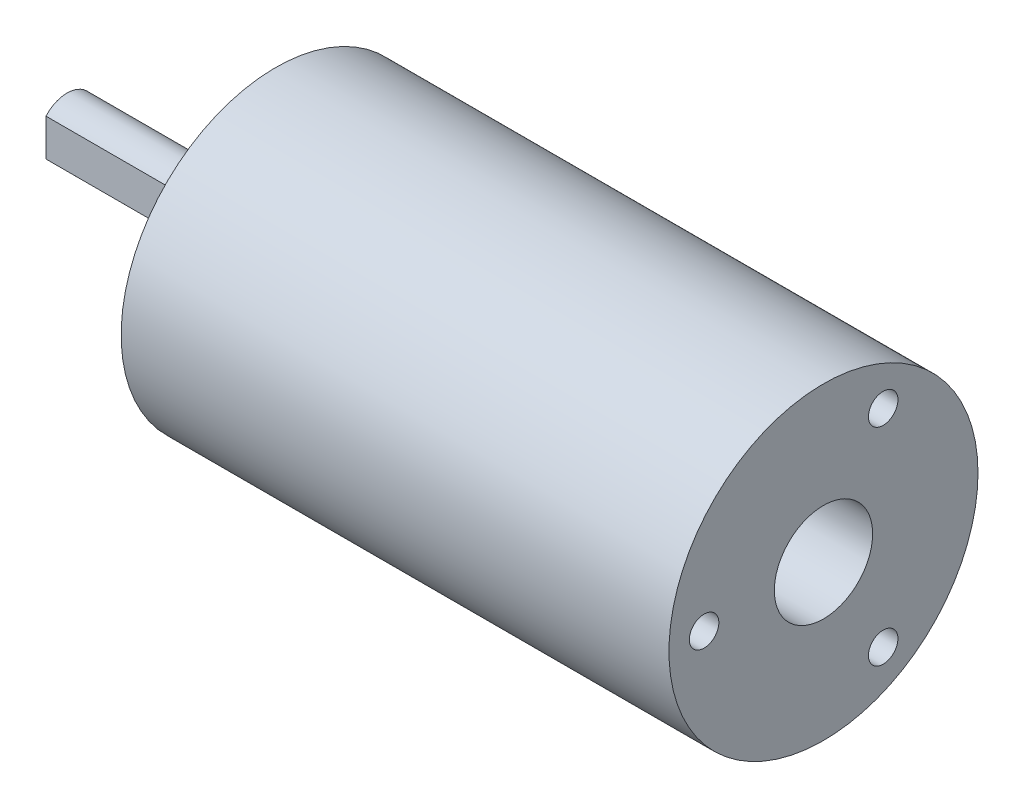
ISO-10303-21;
HEADER;
FILE_DESCRIPTION(('STEP AP214'),'2;1');
FILE_NAME('part.step','',(''),(''),'','','');
FILE_SCHEMA(('AUTOMOTIVE_DESIGN { 1 0 10303 214 1 1 1 1 }'));
ENDSEC;
DATA;
#1=APPLICATION_CONTEXT('core data for automotive mechanical design processes');
#2=APPLICATION_PROTOCOL_DEFINITION('international standard','automotive_design',2000,#1);
#3=PRODUCT_CONTEXT('',#1,'mechanical');
#4=PRODUCT('Part','Part','',(#3));
#5=PRODUCT_RELATED_PRODUCT_CATEGORY('part','',(#4));
#6=PRODUCT_DEFINITION_FORMATION('','',#4);
#7=PRODUCT_DEFINITION_CONTEXT('part definition',#1,'design');
#8=PRODUCT_DEFINITION('design','',#6,#7);
#9=PRODUCT_DEFINITION_SHAPE('','',#8);
#10=(LENGTH_UNIT() NAMED_UNIT(*) SI_UNIT(.MILLI.,.METRE.));
#11=(NAMED_UNIT(*) PLANE_ANGLE_UNIT() SI_UNIT($,.RADIAN.));
#12=(NAMED_UNIT(*) SI_UNIT($,.STERADIAN.) SOLID_ANGLE_UNIT());
#13=UNCERTAINTY_MEASURE_WITH_UNIT(LENGTH_MEASURE(1.E-05),#10,'distance_accuracy_value','');
#14=(GEOMETRIC_REPRESENTATION_CONTEXT(3) GLOBAL_UNCERTAINTY_ASSIGNED_CONTEXT((#13)) GLOBAL_UNIT_ASSIGNED_CONTEXT((#10,
#11,#12)) REPRESENTATION_CONTEXT('',''));
#15=CARTESIAN_POINT('',(0.,0.,0.));
#16=DIRECTION('',(0.,0.,1.));
#17=DIRECTION('',(1.,0.,0.));
#18=AXIS2_PLACEMENT_3D('',#15,#16,#17);
#19=CARTESIAN_POINT('',(-5.85,-1.32287565553,1.5));
#20=DIRECTION('',(-0.707106781186547,0.,0.707106781186548));
#21=DIRECTION('',(0.707106781186548,0.,0.707106781186547));
#22=AXIS2_PLACEMENT_3D('',#19,#20,#21);
#23=PLANE('',#22);
#24=CARTESIAN_POINT('',(-7.35,0.,0.));
#25=DIRECTION('',(-0.707106781186547,0.,0.707106781186548));
#26=DIRECTION('',(-0.707106781186548,0.,-0.707106781186547));
#27=AXIS2_PLACEMENT_3D('',#24,#25,#26);
#28=ELLIPSE('',#27,2.82842712474619,2.);
#29=CARTESIAN_POINT('',(-5.84999999999943,1.32287565553165,1.50000000000057));
#30=VERTEX_POINT('',#29);
#31=CARTESIAN_POINT('',(-5.84999999999943,-1.32287565553165,1.50000000000057));
#32=VERTEX_POINT('',#31);
#33=EDGE_CURVE('E18',#30,#32,#28,.F.);
#34=ORIENTED_EDGE('',*,*,#33,.F.);
#35=DIRECTION('',(0.,1.,0.));
#36=VECTOR('',#35,1.);
#37=CARTESIAN_POINT('',(-5.85,1.32287565553,1.5));
#38=LINE('',#37,#36);
#39=EDGE_CURVE('E39',#32,#30,#38,.T.);
#40=ORIENTED_EDGE('',*,*,#39,.F.);
#41=EDGE_LOOP('',(#34,#40));
#42=FACE_BOUND('',#41,.T.);
#43=ADVANCED_FACE('F15',(#42),#23,.T.);
#44=CARTESIAN_POINT('',(-14.85,1.32287565553,1.5));
#45=DIRECTION('',(0.,0.,1.));
#46=DIRECTION('',(1.,0.,0.));
#47=AXIS2_PLACEMENT_3D('',#44,#45,#46);
#48=PLANE('',#47);
#49=ORIENTED_EDGE('',*,*,#39,.T.);
#50=DIRECTION('',(-1.,0.,0.));
#51=VECTOR('',#50,1.);
#52=CARTESIAN_POINT('',(-3.14999999,1.322875655531,1.50000000000114));
#53=LINE('',#52,#51);
#54=CARTESIAN_POINT('',(-14.85,1.32287565553165,1.50000000000057));
#55=VERTEX_POINT('',#54);
#56=EDGE_CURVE('E43',#55,#30,#53,.F.);
#57=ORIENTED_EDGE('',*,*,#56,.F.);
#58=DIRECTION('',(0.,-1.,0.));
#59=VECTOR('',#58,1.);
#60=CARTESIAN_POINT('',(-14.85,1.32287565553,1.5));
#61=LINE('',#60,#59);
#62=CARTESIAN_POINT('',(-14.85,-1.32287565553165,1.50000000000057));
#63=VERTEX_POINT('',#62);
#64=EDGE_CURVE('E32',#63,#55,#61,.F.);
#65=ORIENTED_EDGE('',*,*,#64,.F.);
#66=DIRECTION('',(-1.,0.,0.));
#67=VECTOR('',#66,1.);
#68=CARTESIAN_POINT('',(-3.14999999,-1.322875655531,1.50000000000114));
#69=LINE('',#68,#67);
#70=EDGE_CURVE('E45',#32,#63,#69,.T.);
#71=ORIENTED_EDGE('',*,*,#70,.F.);
#72=EDGE_LOOP('',(#49,#57,#65,#71));
#73=FACE_BOUND('',#72,.T.);
#74=ADVANCED_FACE('F41',(#73),#48,.T.);
#75=CARTESIAN_POINT('',(-14.85,1.32287565553,1.5));
#76=DIRECTION('',(-1.,0.,0.));
#77=DIRECTION('',(0.,-1.,0.));
#78=AXIS2_PLACEMENT_3D('',#75,#76,#77);
#79=PLANE('',#78);
#80=ORIENTED_EDGE('',*,*,#64,.T.);
#81=CARTESIAN_POINT('',(-14.85,0.,0.));
#82=DIRECTION('',(-1.,0.,0.));
#83=DIRECTION('',(0.,0.,1.));
#84=AXIS2_PLACEMENT_3D('',#81,#82,#83);
#85=CIRCLE('',#84,2.);
#86=EDGE_CURVE('E52',#63,#55,#85,.F.);
#87=ORIENTED_EDGE('',*,*,#86,.F.);
#88=EDGE_LOOP('',(#80,#87));
#89=FACE_BOUND('',#88,.T.);
#90=ADVANCED_FACE('F121',(#89),#79,.T.);
#91=CARTESIAN_POINT('',(-3.14999999,0.,0.));
#92=DIRECTION('',(-1.,0.,0.));
#93=DIRECTION('',(0.,0.,1.));
#94=AXIS2_PLACEMENT_3D('',#91,#92,#93);
#95=CYLINDRICAL_SURFACE('',#94,2.);
#96=CARTESIAN_POINT('',(-3.15,0.,0.));
#97=DIRECTION('',(-1.,0.,0.));
#98=DIRECTION('',(0.,0.,1.));
#99=AXIS2_PLACEMENT_3D('',#96,#97,#98);
#100=CIRCLE('',#99,2.);
#101=CARTESIAN_POINT('',(-3.15,0.,2.));
#102=VERTEX_POINT('',#101);
#103=EDGE_CURVE('E113',#102,#102,#100,.F.);
#104=ORIENTED_EDGE('',*,*,#103,.F.);
#105=EDGE_LOOP('',(#104));
#106=FACE_BOUND('',#105,.T.);
#107=ORIENTED_EDGE('',*,*,#70,.T.);
#108=ORIENTED_EDGE('',*,*,#86,.T.);
#109=ORIENTED_EDGE('',*,*,#56,.T.);
#110=ORIENTED_EDGE('',*,*,#33,.T.);
#111=EDGE_LOOP('',(#107,#108,#109,#110));
#112=FACE_BOUND('',#111,.T.);
#113=ADVANCED_FACE('F51',(#106,#112),#95,.T.);
#114=CARTESIAN_POINT('',(-3.15,-3.5,0.));
#115=DIRECTION('',(-1.,0.,0.));
#116=DIRECTION('',(0.,-1.,0.));
#117=AXIS2_PLACEMENT_3D('',#114,#115,#116);
#118=PLANE('',#117);
#119=ORIENTED_EDGE('',*,*,#103,.T.);
#120=EDGE_LOOP('',(#119));
#121=FACE_BOUND('',#120,.T.);
#122=CARTESIAN_POINT('',(-3.15,0.,0.));
#123=DIRECTION('',(-1.,0.,0.));
#124=DIRECTION('',(0.,-1.,0.));
#125=AXIS2_PLACEMENT_3D('',#122,#123,#124);
#126=CIRCLE('',#125,3.5);
#127=CARTESIAN_POINT('',(-3.15,-3.5,0.));
#128=VERTEX_POINT('',#127);
#129=EDGE_CURVE('E110',#128,#128,#126,.F.);
#130=ORIENTED_EDGE('',*,*,#129,.F.);
#131=EDGE_LOOP('',(#130));
#132=FACE_BOUND('',#131,.T.);
#133=ADVANCED_FACE('F117',(#121,#132),#118,.T.);
#134=CARTESIAN_POINT('',(-1.34999999,0.,0.));
#135=DIRECTION('',(-1.,0.,0.));
#136=DIRECTION('',(0.,-1.,0.));
#137=AXIS2_PLACEMENT_3D('',#134,#135,#136);
#138=CYLINDRICAL_SURFACE('',#137,3.5);
#139=ORIENTED_EDGE('',*,*,#129,.T.);
#140=EDGE_LOOP('',(#139));
#141=FACE_BOUND('',#140,.T.);
#142=CARTESIAN_POINT('',(-1.35,0.,0.));
#143=DIRECTION('',(-1.,0.,0.));
#144=DIRECTION('',(0.,-1.,0.));
#145=AXIS2_PLACEMENT_3D('',#142,#143,#144);
#146=CIRCLE('',#145,3.5);
#147=CARTESIAN_POINT('',(-1.35,-3.5,0.));
#148=VERTEX_POINT('',#147);
#149=EDGE_CURVE('E107',#148,#148,#146,.F.);
#150=ORIENTED_EDGE('',*,*,#149,.F.);
#151=EDGE_LOOP('',(#150));
#152=FACE_BOUND('',#151,.T.);
#153=ADVANCED_FACE('F128',(#141,#152),#138,.T.);
#154=CARTESIAN_POINT('',(36.,7.88621593217,-3.34067332603));
#155=DIRECTION('',(1.,0.,0.));
#156=DIRECTION('',(0.,0.,-1.));
#157=AXIS2_PLACEMENT_3D('',#154,#155,#156);
#158=PLANE('',#157);
#159=CARTESIAN_POINT('',(36.,7.36121593217,-4.25));
#160=DIRECTION('',(-1.,0.,0.));
#161=DIRECTION('',(0.,-1.,0.));
#162=AXIS2_PLACEMENT_3D('',#159,#160,#161);
#163=CIRCLE('',#162,1.05);
#164=CARTESIAN_POINT('',(36.,6.31121593217,-4.25));
#165=VERTEX_POINT('',#164);
#166=EDGE_CURVE('E104',#165,#165,#163,.F.);
#167=ORIENTED_EDGE('',*,*,#166,.T.);
#168=EDGE_LOOP('',(#167));
#169=FACE_BOUND('',#168,.T.);
#170=ADVANCED_FACE('F207',(#169),#158,.T.);
#171=CARTESIAN_POINT('',(36.,-6.83621593217,-5.15932667397));
#172=DIRECTION('',(1.,0.,0.));
#173=DIRECTION('',(0.,0.,-1.));
#174=AXIS2_PLACEMENT_3D('',#171,#172,#173);
#175=PLANE('',#174);
#176=CARTESIAN_POINT('',(36.,-7.36121593217,-4.25));
#177=DIRECTION('',(-1.,0.,0.));
#178=DIRECTION('',(0.,-1.,0.));
#179=AXIS2_PLACEMENT_3D('',#176,#177,#178);
#180=CIRCLE('',#179,1.05);
#181=CARTESIAN_POINT('',(36.,-8.41121593217,-4.25));
#182=VERTEX_POINT('',#181);
#183=EDGE_CURVE('E101',#182,#182,#180,.F.);
#184=ORIENTED_EDGE('',*,*,#183,.T.);
#185=EDGE_LOOP('',(#184));
#186=FACE_BOUND('',#185,.T.);
#187=ADVANCED_FACE('F203',(#186),#175,.T.);
#188=CARTESIAN_POINT('',(36.,1.05,8.5));
#189=DIRECTION('',(1.,0.,0.));
#190=DIRECTION('',(0.,0.,-1.));
#191=AXIS2_PLACEMENT_3D('',#188,#189,#190);
#192=PLANE('',#191);
#193=CARTESIAN_POINT('',(36.,0.,8.5));
#194=DIRECTION('',(-1.,0.,0.));
#195=DIRECTION('',(0.,-1.,0.));
#196=AXIS2_PLACEMENT_3D('',#193,#194,#195);
#197=CIRCLE('',#196,1.05);
#198=CARTESIAN_POINT('',(36.,-1.05,8.5));
#199=VERTEX_POINT('',#198);
#200=EDGE_CURVE('E98',#199,#199,#197,.F.);
#201=ORIENTED_EDGE('',*,*,#200,.T.);
#202=EDGE_LOOP('',(#201));
#203=FACE_BOUND('',#202,.T.);
#204=ADVANCED_FACE('F199',(#203),#192,.T.);
#205=CARTESIAN_POINT('',(32.6,3.5,0.));
#206=DIRECTION('',(1.,0.,0.));
#207=DIRECTION('',(0.,0.,-1.));
#208=AXIS2_PLACEMENT_3D('',#205,#206,#207);
#209=PLANE('',#208);
#210=CARTESIAN_POINT('',(32.6,0.,0.));
#211=DIRECTION('',(-1.,0.,0.));
#212=DIRECTION('',(0.,-1.,0.));
#213=AXIS2_PLACEMENT_3D('',#210,#211,#212);
#214=CIRCLE('',#213,3.5);
#215=CARTESIAN_POINT('',(32.6,-3.5,0.));
#216=VERTEX_POINT('',#215);
#217=EDGE_CURVE('E95',#216,#216,#214,.F.);
#218=ORIENTED_EDGE('',*,*,#217,.T.);
#219=EDGE_LOOP('',(#218));
#220=FACE_BOUND('',#219,.T.);
#221=ADVANCED_FACE('F195',(#220),#209,.T.);
#222=CARTESIAN_POINT('',(6.5,6.54967782649,-2.65562523131));
#223=DIRECTION('',(-1.,0.,0.));
#224=DIRECTION('',(0.,-1.,0.));
#225=AXIS2_PLACEMENT_3D('',#222,#223,#224);
#226=PLANE('',#225);
#227=CARTESIAN_POINT('',(6.5,6.06217782649,-3.5));
#228=DIRECTION('',(1.,0.,0.));
#229=DIRECTION('',(0.,0.,-1.));
#230=AXIS2_PLACEMENT_3D('',#227,#228,#229);
#231=CIRCLE('',#230,0.975);
#232=CARTESIAN_POINT('',(6.5,6.06217782649,-4.475));
#233=VERTEX_POINT('',#232);
#234=EDGE_CURVE('E92',#233,#233,#231,.F.);
#235=ORIENTED_EDGE('',*,*,#234,.T.);
#236=EDGE_LOOP('',(#235));
#237=FACE_BOUND('',#236,.T.);
#238=ADVANCED_FACE('F191',(#237),#226,.T.);
#239=CARTESIAN_POINT('',(6.5,-5.57467782649,-4.34437476869));
#240=DIRECTION('',(-1.,0.,0.));
#241=DIRECTION('',(0.,-1.,0.));
#242=AXIS2_PLACEMENT_3D('',#239,#240,#241);
#243=PLANE('',#242);
#244=CARTESIAN_POINT('',(6.5,-6.06217782649,-3.5));
#245=DIRECTION('',(1.,0.,0.));
#246=DIRECTION('',(0.,0.,-1.));
#247=AXIS2_PLACEMENT_3D('',#244,#245,#246);
#248=CIRCLE('',#247,0.975);
#249=CARTESIAN_POINT('',(6.5,-6.06217782649,-4.475));
#250=VERTEX_POINT('',#249);
#251=EDGE_CURVE('E89',#250,#250,#248,.F.);
#252=ORIENTED_EDGE('',*,*,#251,.T.);
#253=EDGE_LOOP('',(#252));
#254=FACE_BOUND('',#253,.T.);
#255=ADVANCED_FACE('F187',(#254),#243,.T.);
#256=CARTESIAN_POINT('',(6.5,0.975,7.));
#257=DIRECTION('',(-1.,0.,0.));
#258=DIRECTION('',(0.,-1.,0.));
#259=AXIS2_PLACEMENT_3D('',#256,#257,#258);
#260=PLANE('',#259);
#261=CARTESIAN_POINT('',(6.5,0.,7.));
#262=DIRECTION('',(1.,0.,0.));
#263=DIRECTION('',(0.,0.,-1.));
#264=AXIS2_PLACEMENT_3D('',#261,#262,#263);
#265=CIRCLE('',#264,0.975);
#266=CARTESIAN_POINT('',(6.5,0.,6.025));
#267=VERTEX_POINT('',#266);
#268=EDGE_CURVE('E86',#267,#267,#265,.F.);
#269=ORIENTED_EDGE('',*,*,#268,.T.);
#270=EDGE_LOOP('',(#269));
#271=FACE_BOUND('',#270,.T.);
#272=ADVANCED_FACE('F183',(#271),#260,.T.);
#273=CARTESIAN_POINT('',(-1.35,5.,0.));
#274=DIRECTION('',(-1.,0.,0.));
#275=DIRECTION('',(0.,-1.,0.));
#276=AXIS2_PLACEMENT_3D('',#273,#274,#275);
#277=PLANE('',#276);
#278=ORIENTED_EDGE('',*,*,#149,.T.);
#279=EDGE_LOOP('',(#278));
#280=FACE_BOUND('',#279,.T.);
#281=CARTESIAN_POINT('',(-1.35,0.,0.));
#282=DIRECTION('',(1.,0.,0.));
#283=DIRECTION('',(0.,0.,-1.));
#284=AXIS2_PLACEMENT_3D('',#281,#282,#283);
#285=CIRCLE('',#284,5.);
#286=CARTESIAN_POINT('',(-1.35,0.,-5.));
#287=VERTEX_POINT('',#286);
#288=EDGE_CURVE('E83',#287,#287,#285,.T.);
#289=ORIENTED_EDGE('',*,*,#288,.F.);
#290=EDGE_LOOP('',(#289));
#291=FACE_BOUND('',#290,.T.);
#292=ADVANCED_FACE('F179',(#280,#291),#277,.T.);
#293=CARTESIAN_POINT('',(39.00000001,7.36121593217,-4.25));
#294=DIRECTION('',(-1.,0.,0.));
#295=DIRECTION('',(0.,-1.,0.));
#296=AXIS2_PLACEMENT_3D('',#293,#294,#295);
#297=CYLINDRICAL_SURFACE('',#296,1.05);
#298=ORIENTED_EDGE('',*,*,#166,.F.);
#299=EDGE_LOOP('',(#298));
#300=FACE_BOUND('',#299,.T.);
#301=CARTESIAN_POINT('',(39.,7.36121593217,-4.25));
#302=DIRECTION('',(-1.,0.,0.));
#303=DIRECTION('',(0.,-1.,0.));
#304=AXIS2_PLACEMENT_3D('',#301,#302,#303);
#305=CIRCLE('',#304,1.05);
#306=CARTESIAN_POINT('',(39.,6.31121593217,-4.25));
#307=VERTEX_POINT('',#306);
#308=EDGE_CURVE('E80',#307,#307,#305,.T.);
#309=ORIENTED_EDGE('',*,*,#308,.F.);
#310=EDGE_LOOP('',(#309));
#311=FACE_BOUND('',#310,.T.);
#312=ADVANCED_FACE('F175',(#300,#311),#297,.F.);
#313=CARTESIAN_POINT('',(39.00000001,-7.36121593217,-4.25));
#314=DIRECTION('',(-1.,0.,0.));
#315=DIRECTION('',(0.,-1.,0.));
#316=AXIS2_PLACEMENT_3D('',#313,#314,#315);
#317=CYLINDRICAL_SURFACE('',#316,1.05);
#318=ORIENTED_EDGE('',*,*,#183,.F.);
#319=EDGE_LOOP('',(#318));
#320=FACE_BOUND('',#319,.T.);
#321=CARTESIAN_POINT('',(39.,-7.36121593217,-4.25));
#322=DIRECTION('',(-1.,0.,0.));
#323=DIRECTION('',(0.,-1.,0.));
#324=AXIS2_PLACEMENT_3D('',#321,#322,#323);
#325=CIRCLE('',#324,1.05);
#326=CARTESIAN_POINT('',(39.,-8.41121593217,-4.25));
#327=VERTEX_POINT('',#326);
#328=EDGE_CURVE('E77',#327,#327,#325,.T.);
#329=ORIENTED_EDGE('',*,*,#328,.F.);
#330=EDGE_LOOP('',(#329));
#331=FACE_BOUND('',#330,.T.);
#332=ADVANCED_FACE('F171',(#320,#331),#317,.F.);
#333=CARTESIAN_POINT('',(39.00000001,0.,8.5));
#334=DIRECTION('',(-1.,0.,0.));
#335=DIRECTION('',(0.,-1.,0.));
#336=AXIS2_PLACEMENT_3D('',#333,#334,#335);
#337=CYLINDRICAL_SURFACE('',#336,1.05);
#338=ORIENTED_EDGE('',*,*,#200,.F.);
#339=EDGE_LOOP('',(#338));
#340=FACE_BOUND('',#339,.T.);
#341=CARTESIAN_POINT('',(39.,0.,8.5));
#342=DIRECTION('',(-1.,0.,0.));
#343=DIRECTION('',(0.,-1.,0.));
#344=AXIS2_PLACEMENT_3D('',#341,#342,#343);
#345=CIRCLE('',#344,1.05);
#346=CARTESIAN_POINT('',(39.,-1.05,8.5));
#347=VERTEX_POINT('',#346);
#348=EDGE_CURVE('E74',#347,#347,#345,.T.);
#349=ORIENTED_EDGE('',*,*,#348,.F.);
#350=EDGE_LOOP('',(#349));
#351=FACE_BOUND('',#350,.T.);
#352=ADVANCED_FACE('F167',(#340,#351),#337,.F.);
#353=CARTESIAN_POINT('',(39.00000001,0.,0.));
#354=DIRECTION('',(-1.,0.,0.));
#355=DIRECTION('',(0.,-1.,0.));
#356=AXIS2_PLACEMENT_3D('',#353,#354,#355);
#357=CYLINDRICAL_SURFACE('',#356,3.5);
#358=ORIENTED_EDGE('',*,*,#217,.F.);
#359=EDGE_LOOP('',(#358));
#360=FACE_BOUND('',#359,.T.);
#361=CARTESIAN_POINT('',(39.,0.,0.));
#362=DIRECTION('',(-1.,0.,0.));
#363=DIRECTION('',(0.,-1.,0.));
#364=AXIS2_PLACEMENT_3D('',#361,#362,#363);
#365=CIRCLE('',#364,3.5);
#366=CARTESIAN_POINT('',(39.,-3.5,0.));
#367=VERTEX_POINT('',#366);
#368=EDGE_CURVE('E71',#367,#367,#365,.T.);
#369=ORIENTED_EDGE('',*,*,#368,.F.);
#370=EDGE_LOOP('',(#369));
#371=FACE_BOUND('',#370,.T.);
#372=ADVANCED_FACE('F163',(#360,#371),#357,.F.);
#373=CARTESIAN_POINT('',(-9.99999993922529E-09,6.06217782649,-3.5));
#374=DIRECTION('',(1.,0.,0.));
#375=DIRECTION('',(0.,0.,-1.));
#376=AXIS2_PLACEMENT_3D('',#373,#374,#375);
#377=CYLINDRICAL_SURFACE('',#376,0.975);
#378=ORIENTED_EDGE('',*,*,#234,.F.);
#379=EDGE_LOOP('',(#378));
#380=FACE_BOUND('',#379,.T.);
#381=CARTESIAN_POINT('',(0.,6.06217782649,-3.5));
#382=DIRECTION('',(1.,0.,0.));
#383=DIRECTION('',(0.,0.,-1.));
#384=AXIS2_PLACEMENT_3D('',#381,#382,#383);
#385=CIRCLE('',#384,0.975);
#386=CARTESIAN_POINT('',(0.,6.06217782649,-4.475));
#387=VERTEX_POINT('',#386);
#388=EDGE_CURVE('E68',#387,#387,#385,.T.);
#389=ORIENTED_EDGE('',*,*,#388,.F.);
#390=EDGE_LOOP('',(#389));
#391=FACE_BOUND('',#390,.T.);
#392=ADVANCED_FACE('F159',(#380,#391),#377,.F.);
#393=CARTESIAN_POINT('',(-9.99999993922529E-09,-6.06217782649,-3.5));
#394=DIRECTION('',(1.,0.,0.));
#395=DIRECTION('',(0.,0.,-1.));
#396=AXIS2_PLACEMENT_3D('',#393,#394,#395);
#397=CYLINDRICAL_SURFACE('',#396,0.975);
#398=ORIENTED_EDGE('',*,*,#251,.F.);
#399=EDGE_LOOP('',(#398));
#400=FACE_BOUND('',#399,.T.);
#401=CARTESIAN_POINT('',(0.,-6.06217782649,-3.5));
#402=DIRECTION('',(1.,0.,0.));
#403=DIRECTION('',(0.,0.,-1.));
#404=AXIS2_PLACEMENT_3D('',#401,#402,#403);
#405=CIRCLE('',#404,0.975);
#406=CARTESIAN_POINT('',(0.,-6.06217782649,-4.475));
#407=VERTEX_POINT('',#406);
#408=EDGE_CURVE('E65',#407,#407,#405,.T.);
#409=ORIENTED_EDGE('',*,*,#408,.F.);
#410=EDGE_LOOP('',(#409));
#411=FACE_BOUND('',#410,.T.);
#412=ADVANCED_FACE('F155',(#400,#411),#397,.F.);
#413=CARTESIAN_POINT('',(-9.99999993922529E-09,0.,7.));
#414=DIRECTION('',(1.,0.,0.));
#415=DIRECTION('',(0.,0.,-1.));
#416=AXIS2_PLACEMENT_3D('',#413,#414,#415);
#417=CYLINDRICAL_SURFACE('',#416,0.975);
#418=ORIENTED_EDGE('',*,*,#268,.F.);
#419=EDGE_LOOP('',(#418));
#420=FACE_BOUND('',#419,.T.);
#421=CARTESIAN_POINT('',(0.,0.,7.));
#422=DIRECTION('',(1.,0.,0.));
#423=DIRECTION('',(0.,0.,-1.));
#424=AXIS2_PLACEMENT_3D('',#421,#422,#423);
#425=CIRCLE('',#424,0.975);
#426=CARTESIAN_POINT('',(0.,0.,6.025));
#427=VERTEX_POINT('',#426);
#428=EDGE_CURVE('E62',#427,#427,#425,.T.);
#429=ORIENTED_EDGE('',*,*,#428,.F.);
#430=EDGE_LOOP('',(#429));
#431=FACE_BOUND('',#430,.T.);
#432=ADVANCED_FACE('F151',(#420,#431),#417,.F.);
#433=CARTESIAN_POINT('',(-1.35000001,0.,0.));
#434=DIRECTION('',(1.,0.,0.));
#435=DIRECTION('',(0.,0.,-1.));
#436=AXIS2_PLACEMENT_3D('',#433,#434,#435);
#437=CYLINDRICAL_SURFACE('',#436,5.);
#438=ORIENTED_EDGE('',*,*,#288,.T.);
#439=EDGE_LOOP('',(#438));
#440=FACE_BOUND('',#439,.T.);
#441=CARTESIAN_POINT('',(0.,0.,0.));
#442=DIRECTION('',(1.,0.,0.));
#443=DIRECTION('',(0.,0.,-1.));
#444=AXIS2_PLACEMENT_3D('',#441,#442,#443);
#445=CIRCLE('',#444,5.);
#446=CARTESIAN_POINT('',(0.,0.,-5.));
#447=VERTEX_POINT('',#446);
#448=EDGE_CURVE('E59',#447,#447,#445,.T.);
#449=ORIENTED_EDGE('',*,*,#448,.F.);
#450=EDGE_LOOP('',(#449));
#451=FACE_BOUND('',#450,.T.);
#452=ADVANCED_FACE('F147',(#440,#451),#437,.T.);
#453=CARTESIAN_POINT('',(39.,0.,11.));
#454=DIRECTION('',(1.,0.,0.));
#455=DIRECTION('',(0.,0.,-1.));
#456=AXIS2_PLACEMENT_3D('',#453,#454,#455);
#457=PLANE('',#456);
#458=ORIENTED_EDGE('',*,*,#368,.T.);
#459=EDGE_LOOP('',(#458));
#460=FACE_BOUND('',#459,.T.);
#461=ORIENTED_EDGE('',*,*,#348,.T.);
#462=EDGE_LOOP('',(#461));
#463=FACE_BOUND('',#462,.T.);
#464=ORIENTED_EDGE('',*,*,#328,.T.);
#465=EDGE_LOOP('',(#464));
#466=FACE_BOUND('',#465,.T.);
#467=ORIENTED_EDGE('',*,*,#308,.T.);
#468=EDGE_LOOP('',(#467));
#469=FACE_BOUND('',#468,.T.);
#470=CARTESIAN_POINT('',(39.,0.,0.));
#471=DIRECTION('',(1.,0.,0.));
#472=DIRECTION('',(0.,0.,-1.));
#473=AXIS2_PLACEMENT_3D('',#470,#471,#472);
#474=CIRCLE('',#473,11.);
#475=CARTESIAN_POINT('',(39.,0.,-11.));
#476=VERTEX_POINT('',#475);
#477=EDGE_CURVE('E24',#476,#476,#474,.F.);
#478=ORIENTED_EDGE('',*,*,#477,.F.);
#479=EDGE_LOOP('',(#478));
#480=FACE_BOUND('',#479,.T.);
#481=ADVANCED_FACE('F140',(#460,#463,#466,#469,#480),#457,.T.);
#482=CARTESIAN_POINT('',(0.,0.,11.));
#483=DIRECTION('',(-1.,0.,0.));
#484=DIRECTION('',(0.,-1.,0.));
#485=AXIS2_PLACEMENT_3D('',#482,#483,#484);
#486=PLANE('',#485);
#487=ORIENTED_EDGE('',*,*,#448,.T.);
#488=EDGE_LOOP('',(#487));
#489=FACE_BOUND('',#488,.T.);
#490=ORIENTED_EDGE('',*,*,#428,.T.);
#491=EDGE_LOOP('',(#490));
#492=FACE_BOUND('',#491,.T.);
#493=ORIENTED_EDGE('',*,*,#408,.T.);
#494=EDGE_LOOP('',(#493));
#495=FACE_BOUND('',#494,.T.);
#496=ORIENTED_EDGE('',*,*,#388,.T.);
#497=EDGE_LOOP('',(#496));
#498=FACE_BOUND('',#497,.T.);
#499=CARTESIAN_POINT('',(0.,0.,0.));
#500=DIRECTION('',(1.,0.,0.));
#501=DIRECTION('',(0.,0.,-1.));
#502=AXIS2_PLACEMENT_3D('',#499,#500,#501);
#503=CIRCLE('',#502,11.);
#504=CARTESIAN_POINT('',(0.,0.,-11.));
#505=VERTEX_POINT('',#504);
#506=EDGE_CURVE('E10',#505,#505,#503,.T.);
#507=ORIENTED_EDGE('',*,*,#506,.F.);
#508=EDGE_LOOP('',(#507));
#509=FACE_BOUND('',#508,.T.);
#510=ADVANCED_FACE('F134',(#489,#492,#495,#498,#509),#486,.T.);
#511=CARTESIAN_POINT('',(1.59999999,0.,0.));
#512=DIRECTION('',(1.,0.,0.));
#513=DIRECTION('',(0.,0.,-1.));
#514=AXIS2_PLACEMENT_3D('',#511,#512,#513);
#515=CYLINDRICAL_SURFACE('',#514,11.);
#516=ORIENTED_EDGE('',*,*,#506,.T.);
#517=EDGE_LOOP('',(#516));
#518=FACE_BOUND('',#517,.T.);
#519=ORIENTED_EDGE('',*,*,#477,.T.);
#520=EDGE_LOOP('',(#519));
#521=FACE_BOUND('',#520,.T.);
#522=ADVANCED_FACE('F132',(#518,#521),#515,.T.);
#523=CLOSED_SHELL('',(#43,#74,#90,#113,#133,#153,#170,#187,#204,#221,#238,#255,#272,#292,#312,
#332,#352,#372,#392,#412,#432,#452,#481,#510,#522));
#524=MANIFOLD_SOLID_BREP('B1',#523);
#525=ADVANCED_BREP_SHAPE_REPRESENTATION('',(#18,#524),#14);
#526=SHAPE_DEFINITION_REPRESENTATION(#9,#525);
ENDSEC;
END-ISO-10303-21;
